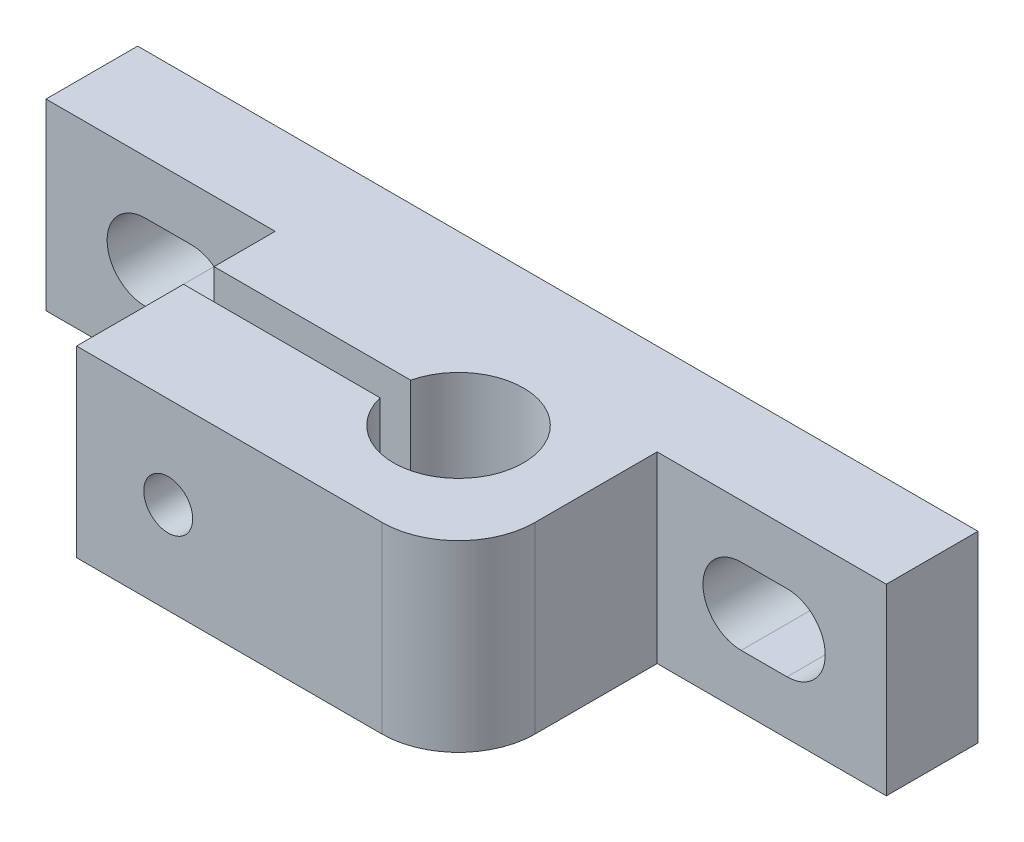
ISO-10303-21;
HEADER;
FILE_DESCRIPTION(('STEP AP214'),'2;1');
FILE_NAME('part.step','',(''),(''),'','','');
FILE_SCHEMA(('AUTOMOTIVE_DESIGN { 1 0 10303 214 1 1 1 1 }'));
ENDSEC;
DATA;
#1=APPLICATION_CONTEXT('core data for automotive mechanical design processes');
#2=APPLICATION_PROTOCOL_DEFINITION('international standard','automotive_design',2000,#1);
#3=PRODUCT_CONTEXT('',#1,'mechanical');
#4=PRODUCT('Part','Part','',(#3));
#5=PRODUCT_RELATED_PRODUCT_CATEGORY('part','',(#4));
#6=PRODUCT_DEFINITION_FORMATION('','',#4);
#7=PRODUCT_DEFINITION_CONTEXT('part definition',#1,'design');
#8=PRODUCT_DEFINITION('design','',#6,#7);
#9=PRODUCT_DEFINITION_SHAPE('','',#8);
#10=(LENGTH_UNIT() NAMED_UNIT(*) SI_UNIT(.MILLI.,.METRE.));
#11=(NAMED_UNIT(*) PLANE_ANGLE_UNIT() SI_UNIT($,.RADIAN.));
#12=(NAMED_UNIT(*) SI_UNIT($,.STERADIAN.) SOLID_ANGLE_UNIT());
#13=UNCERTAINTY_MEASURE_WITH_UNIT(LENGTH_MEASURE(1.E-05),#10,'distance_accuracy_value','');
#14=(GEOMETRIC_REPRESENTATION_CONTEXT(3) GLOBAL_UNCERTAINTY_ASSIGNED_CONTEXT((#13)) GLOBAL_UNIT_ASSIGNED_CONTEXT((#10,
#11,#12)) REPRESENTATION_CONTEXT('',''));
#15=CARTESIAN_POINT('',(0.,0.,0.));
#16=DIRECTION('',(0.,0.,1.));
#17=DIRECTION('',(1.,0.,0.));
#18=AXIS2_PLACEMENT_3D('',#15,#16,#17);
#19=CARTESIAN_POINT('',(15.,0.,19.));
#20=DIRECTION('',(1.,0.,0.));
#21=DIRECTION('',(0.,0.,-1.));
#22=AXIS2_PLACEMENT_3D('',#19,#20,#21);
#23=PLANE('',#22);
#24=DIRECTION('',(0.,0.,-1.));
#25=VECTOR('',#24,1.);
#26=CARTESIAN_POINT('',(15.,0.,19.));
#27=LINE('',#26,#25);
#28=CARTESIAN_POINT('',(15.,0.,10.));
#29=VERTEX_POINT('',#28);
#30=CARTESIAN_POINT('',(15.,0.,6.));
#31=VERTEX_POINT('',#30);
#32=EDGE_CURVE('E382',#29,#31,#27,.T.);
#33=ORIENTED_EDGE('',*,*,#32,.F.);
#34=DIRECTION('',(0.,1.,0.));
#35=VECTOR('',#34,1.);
#36=CARTESIAN_POINT('',(15.,0.,10.));
#37=LINE('',#36,#35);
#38=CARTESIAN_POINT('',(15.,12.,10.));
#39=VERTEX_POINT('',#38);
#40=EDGE_CURVE('E42',#29,#39,#37,.T.);
#41=ORIENTED_EDGE('',*,*,#40,.T.);
#42=DIRECTION('',(0.,0.,-1.));
#43=VECTOR('',#42,1.);
#44=CARTESIAN_POINT('',(15.,12.,19.));
#45=LINE('',#44,#43);
#46=CARTESIAN_POINT('',(15.,12.,6.));
#47=VERTEX_POINT('',#46);
#48=EDGE_CURVE('E359',#39,#47,#45,.T.);
#49=ORIENTED_EDGE('',*,*,#48,.T.);
#50=DIRECTION('',(0.,-1.,0.));
#51=VECTOR('',#50,1.);
#52=CARTESIAN_POINT('',(15.,0.,6.));
#53=LINE('',#52,#51);
#54=EDGE_CURVE('E349',#47,#31,#53,.T.);
#55=ORIENTED_EDGE('',*,*,#54,.T.);
#56=EDGE_LOOP('',(#33,#41,#49,#55));
#57=FACE_BOUND('',#56,.T.);
#58=ADVANCED_FACE('F33',(#57),#23,.F.);
#59=CARTESIAN_POINT('',(0.,0.,6.));
#60=DIRECTION('',(0.,0.,-1.));
#61=DIRECTION('',(-1.,0.,0.));
#62=AXIS2_PLACEMENT_3D('',#59,#60,#61);
#63=PLANE('',#62);
#64=CARTESIAN_POINT('',(6.5,6.,6.));
#65=DIRECTION('',(0.,0.,1.));
#66=DIRECTION('',(1.,0.,0.));
#67=AXIS2_PLACEMENT_3D('',#64,#65,#66);
#68=CIRCLE('',#67,2.50000000000001);
#69=CARTESIAN_POINT('',(6.5,8.5,6.));
#70=VERTEX_POINT('',#69);
#71=CARTESIAN_POINT('',(6.5,3.49999999999999,6.));
#72=VERTEX_POINT('',#71);
#73=EDGE_CURVE('E460',#70,#72,#68,.T.);
#74=ORIENTED_EDGE('',*,*,#73,.F.);
#75=DIRECTION('',(-1.,0.,0.));
#76=VECTOR('',#75,1.);
#77=CARTESIAN_POINT('',(6.5,8.5,6.));
#78=LINE('',#77,#76);
#79=CARTESIAN_POINT('',(9.5,8.5,6.));
#80=VERTEX_POINT('',#79);
#81=EDGE_CURVE('E456',#80,#70,#78,.T.);
#82=ORIENTED_EDGE('',*,*,#81,.F.);
#83=CARTESIAN_POINT('',(9.5,6.,6.));
#84=DIRECTION('',(0.,0.,1.));
#85=DIRECTION('',(1.,0.,0.));
#86=AXIS2_PLACEMENT_3D('',#83,#84,#85);
#87=CIRCLE('',#86,2.50000000000001);
#88=CARTESIAN_POINT('',(9.49999999999999,3.49999999999999,6.));
#89=VERTEX_POINT('',#88);
#90=EDGE_CURVE('E472',#89,#80,#87,.T.);
#91=ORIENTED_EDGE('',*,*,#90,.F.);
#92=DIRECTION('',(1.,0.,0.));
#93=VECTOR('',#92,1.);
#94=CARTESIAN_POINT('',(6.5,3.49999999999999,6.));
#95=LINE('',#94,#93);
#96=EDGE_CURVE('E475',#72,#89,#95,.T.);
#97=ORIENTED_EDGE('',*,*,#96,.F.);
#98=EDGE_LOOP('',(#74,#82,#91,#97));
#99=FACE_BOUND('',#98,.T.);
#100=ORIENTED_EDGE('',*,*,#54,.F.);
#101=DIRECTION('',(-1.,0.,0.));
#102=VECTOR('',#101,1.);
#103=CARTESIAN_POINT('',(0.,12.,6.));
#104=LINE('',#103,#102);
#105=CARTESIAN_POINT('',(0.,12.,6.));
#106=VERTEX_POINT('',#105);
#107=EDGE_CURVE('E399',#47,#106,#104,.T.);
#108=ORIENTED_EDGE('',*,*,#107,.T.);
#109=DIRECTION('',(0.,-1.,0.));
#110=VECTOR('',#109,1.);
#111=CARTESIAN_POINT('',(0.,0.,6.));
#112=LINE('',#111,#110);
#113=CARTESIAN_POINT('',(0.,0.,6.));
#114=VERTEX_POINT('',#113);
#115=EDGE_CURVE('E430',#106,#114,#112,.T.);
#116=ORIENTED_EDGE('',*,*,#115,.T.);
#117=DIRECTION('',(1.,0.,0.));
#118=VECTOR('',#117,1.);
#119=CARTESIAN_POINT('',(0.,0.,6.));
#120=LINE('',#119,#118);
#121=EDGE_CURVE('E410',#114,#31,#120,.T.);
#122=ORIENTED_EDGE('',*,*,#121,.T.);
#123=EDGE_LOOP('',(#100,#108,#116,#122));
#124=FACE_BOUND('',#123,.T.);
#125=ADVANCED_FACE('F541',(#99,#124),#63,.F.);
#126=CARTESIAN_POINT('',(48.5,6.00000000000001,6.));
#127=DIRECTION('',(0.,0.,1.));
#128=DIRECTION('',(-1.,0.,0.));
#129=AXIS2_PLACEMENT_3D('',#126,#127,#128);
#130=CIRCLE('',#129,2.50000000000001);
#131=CARTESIAN_POINT('',(48.5,3.49999999999999,6.));
#132=VERTEX_POINT('',#131);
#133=CARTESIAN_POINT('',(48.5,8.50000000000001,6.));
#134=VERTEX_POINT('',#133);
#135=EDGE_CURVE('E491',#132,#134,#130,.T.);
#136=ORIENTED_EDGE('',*,*,#135,.F.);
#137=DIRECTION('',(1.,0.,0.));
#138=VECTOR('',#137,1.);
#139=CARTESIAN_POINT('',(48.5,3.49999999999999,6.));
#140=LINE('',#139,#138);
#141=CARTESIAN_POINT('',(45.5,3.49999999999999,6.));
#142=VERTEX_POINT('',#141);
#143=EDGE_CURVE('E487',#142,#132,#140,.T.);
#144=ORIENTED_EDGE('',*,*,#143,.F.);
#145=CARTESIAN_POINT('',(45.5,6.,6.));
#146=DIRECTION('',(0.,0.,1.));
#147=DIRECTION('',(-1.,0.,0.));
#148=AXIS2_PLACEMENT_3D('',#145,#146,#147);
#149=CIRCLE('',#148,2.50000000000001);
#150=CARTESIAN_POINT('',(45.5,8.50000000000001,6.));
#151=VERTEX_POINT('',#150);
#152=EDGE_CURVE('E503',#151,#142,#149,.T.);
#153=ORIENTED_EDGE('',*,*,#152,.F.);
#154=DIRECTION('',(-1.,0.,0.));
#155=VECTOR('',#154,1.);
#156=CARTESIAN_POINT('',(48.5,8.50000000000001,6.));
#157=LINE('',#156,#155);
#158=EDGE_CURVE('E506',#134,#151,#157,.T.);
#159=ORIENTED_EDGE('',*,*,#158,.F.);
#160=EDGE_LOOP('',(#136,#144,#153,#159));
#161=FACE_BOUND('',#160,.T.);
#162=DIRECTION('',(0.,1.,0.));
#163=VECTOR('',#162,1.);
#164=CARTESIAN_POINT('',(40.,0.,6.));
#165=LINE('',#164,#163);
#166=CARTESIAN_POINT('',(40.,0.,6.));
#167=VERTEX_POINT('',#166);
#168=CARTESIAN_POINT('',(40.,12.,6.));
#169=VERTEX_POINT('',#168);
#170=EDGE_CURVE('E354',#167,#169,#165,.T.);
#171=ORIENTED_EDGE('',*,*,#170,.F.);
#172=CARTESIAN_POINT('',(55.,0.,6.));
#173=VERTEX_POINT('',#172);
#174=EDGE_CURVE('E442',#167,#173,#120,.T.);
#175=ORIENTED_EDGE('',*,*,#174,.T.);
#176=DIRECTION('',(0.,1.,0.));
#177=VECTOR('',#176,1.);
#178=CARTESIAN_POINT('',(55.,0.,6.));
#179=LINE('',#178,#177);
#180=CARTESIAN_POINT('',(55.,12.,6.));
#181=VERTEX_POINT('',#180);
#182=EDGE_CURVE('E406',#173,#181,#179,.T.);
#183=ORIENTED_EDGE('',*,*,#182,.T.);
#184=EDGE_CURVE('E405',#181,#169,#104,.T.);
#185=ORIENTED_EDGE('',*,*,#184,.T.);
#186=EDGE_LOOP('',(#171,#175,#183,#185));
#187=FACE_BOUND('',#186,.T.);
#188=ADVANCED_FACE('F519',(#161,#187),#63,.F.);
#189=CARTESIAN_POINT('',(0.,0.,0.));
#190=DIRECTION('',(0.,0.,-1.));
#191=DIRECTION('',(-1.,0.,0.));
#192=AXIS2_PLACEMENT_3D('',#189,#190,#191);
#193=PLANE('',#192);
#194=DIRECTION('',(0.,-1.,0.));
#195=VECTOR('',#194,1.);
#196=CARTESIAN_POINT('',(37.6724189772482,9.5,0.));
#197=LINE('',#196,#195);
#198=CARTESIAN_POINT('',(37.6724189772482,9.5,0.));
#199=VERTEX_POINT('',#198);
#200=CARTESIAN_POINT('',(37.6724189772482,2.5,0.));
#201=VERTEX_POINT('',#200);
#202=EDGE_CURVE('E57',#199,#201,#197,.T.);
#203=ORIENTED_EDGE('',*,*,#202,.F.);
#204=DIRECTION('',(1.,0.,0.));
#205=VECTOR('',#204,1.);
#206=CARTESIAN_POINT('',(37.6724189772482,9.5,0.));
#207=LINE('',#206,#205);
#208=CARTESIAN_POINT('',(17.15852847,9.5,0.));
#209=VERTEX_POINT('',#208);
#210=EDGE_CURVE('E305',#209,#199,#207,.T.);
#211=ORIENTED_EDGE('',*,*,#210,.F.);
#212=DIRECTION('',(0.,1.,0.));
#213=VECTOR('',#212,1.);
#214=CARTESIAN_POINT('',(17.15852847,9.5,0.));
#215=LINE('',#214,#213);
#216=CARTESIAN_POINT('',(17.15852847,2.5,0.));
#217=VERTEX_POINT('',#216);
#218=EDGE_CURVE('E319',#217,#209,#215,.T.);
#219=ORIENTED_EDGE('',*,*,#218,.F.);
#220=DIRECTION('',(-1.,0.,0.));
#221=VECTOR('',#220,1.);
#222=CARTESIAN_POINT('',(37.6724189772482,2.5,0.));
#223=LINE('',#222,#221);
#224=EDGE_CURVE('E316',#201,#217,#223,.T.);
#225=ORIENTED_EDGE('',*,*,#224,.F.);
#226=EDGE_LOOP('',(#203,#211,#219,#225));
#227=FACE_BOUND('',#226,.T.);
#228=DIRECTION('',(-1.,0.,0.));
#229=VECTOR('',#228,1.);
#230=CARTESIAN_POINT('',(6.5,8.5,0.));
#231=LINE('',#230,#229);
#232=CARTESIAN_POINT('',(9.5,8.5,0.));
#233=VERTEX_POINT('',#232);
#234=CARTESIAN_POINT('',(6.5,8.5,0.));
#235=VERTEX_POINT('',#234);
#236=EDGE_CURVE('E457',#233,#235,#231,.T.);
#237=ORIENTED_EDGE('',*,*,#236,.T.);
#238=CARTESIAN_POINT('',(6.5,6.,0.));
#239=DIRECTION('',(0.,0.,1.));
#240=DIRECTION('',(1.,0.,0.));
#241=AXIS2_PLACEMENT_3D('',#238,#239,#240);
#242=CIRCLE('',#241,2.50000000000001);
#243=CARTESIAN_POINT('',(6.5,3.49999999999999,0.));
#244=VERTEX_POINT('',#243);
#245=EDGE_CURVE('E467',#235,#244,#242,.T.);
#246=ORIENTED_EDGE('',*,*,#245,.T.);
#247=DIRECTION('',(1.,0.,0.));
#248=VECTOR('',#247,1.);
#249=CARTESIAN_POINT('',(6.5,3.49999999999999,0.));
#250=LINE('',#249,#248);
#251=CARTESIAN_POINT('',(9.49999999999999,3.49999999999999,0.));
#252=VERTEX_POINT('',#251);
#253=EDGE_CURVE('E464',#244,#252,#250,.T.);
#254=ORIENTED_EDGE('',*,*,#253,.T.);
#255=CARTESIAN_POINT('',(9.5,6.,0.));
#256=DIRECTION('',(0.,0.,1.));
#257=DIRECTION('',(1.,0.,0.));
#258=AXIS2_PLACEMENT_3D('',#255,#256,#257);
#259=CIRCLE('',#258,2.50000000000001);
#260=EDGE_CURVE('E461',#252,#233,#259,.T.);
#261=ORIENTED_EDGE('',*,*,#260,.T.);
#262=EDGE_LOOP('',(#237,#246,#254,#261));
#263=FACE_BOUND('',#262,.T.);
#264=DIRECTION('',(0.,-1.,0.));
#265=VECTOR('',#264,1.);
#266=CARTESIAN_POINT('',(0.,0.,0.));
#267=LINE('',#266,#265);
#268=CARTESIAN_POINT('',(0.,12.,0.));
#269=VERTEX_POINT('',#268);
#270=CARTESIAN_POINT('',(0.,0.,0.));
#271=VERTEX_POINT('',#270);
#272=EDGE_CURVE('E419',#269,#271,#267,.T.);
#273=ORIENTED_EDGE('',*,*,#272,.F.);
#274=DIRECTION('',(-1.,0.,0.));
#275=VECTOR('',#274,1.);
#276=CARTESIAN_POINT('',(0.,12.,0.));
#277=LINE('',#276,#275);
#278=CARTESIAN_POINT('',(55.,12.,0.));
#279=VERTEX_POINT('',#278);
#280=EDGE_CURVE('E428',#279,#269,#277,.T.);
#281=ORIENTED_EDGE('',*,*,#280,.F.);
#282=DIRECTION('',(0.,1.,0.));
#283=VECTOR('',#282,1.);
#284=CARTESIAN_POINT('',(55.,0.,0.));
#285=LINE('',#284,#283);
#286=CARTESIAN_POINT('',(55.,0.,0.));
#287=VERTEX_POINT('',#286);
#288=EDGE_CURVE('E426',#287,#279,#285,.T.);
#289=ORIENTED_EDGE('',*,*,#288,.F.);
#290=DIRECTION('',(1.,0.,0.));
#291=VECTOR('',#290,1.);
#292=CARTESIAN_POINT('',(0.,0.,0.));
#293=LINE('',#292,#291);
#294=EDGE_CURVE('E423',#271,#287,#293,.T.);
#295=ORIENTED_EDGE('',*,*,#294,.F.);
#296=EDGE_LOOP('',(#273,#281,#289,#295));
#297=FACE_BOUND('',#296,.T.);
#298=DIRECTION('',(1.,0.,0.));
#299=VECTOR('',#298,1.);
#300=CARTESIAN_POINT('',(48.5,3.49999999999999,0.));
#301=LINE('',#300,#299);
#302=CARTESIAN_POINT('',(45.5,3.5,0.));
#303=VERTEX_POINT('',#302);
#304=CARTESIAN_POINT('',(48.5,3.49999999999999,0.));
#305=VERTEX_POINT('',#304);
#306=EDGE_CURVE('E488',#303,#305,#301,.T.);
#307=ORIENTED_EDGE('',*,*,#306,.T.);
#308=CARTESIAN_POINT('',(48.5,6.00000000000001,0.));
#309=DIRECTION('',(0.,0.,1.));
#310=DIRECTION('',(-1.,0.,0.));
#311=AXIS2_PLACEMENT_3D('',#308,#309,#310);
#312=CIRCLE('',#311,2.50000000000001);
#313=CARTESIAN_POINT('',(48.5,8.50000000000001,0.));
#314=VERTEX_POINT('',#313);
#315=EDGE_CURVE('E498',#305,#314,#312,.T.);
#316=ORIENTED_EDGE('',*,*,#315,.T.);
#317=DIRECTION('',(-1.,0.,0.));
#318=VECTOR('',#317,1.);
#319=CARTESIAN_POINT('',(48.5,8.50000000000001,0.));
#320=LINE('',#319,#318);
#321=CARTESIAN_POINT('',(45.5,8.50000000000001,0.));
#322=VERTEX_POINT('',#321);
#323=EDGE_CURVE('E495',#314,#322,#320,.T.);
#324=ORIENTED_EDGE('',*,*,#323,.T.);
#325=CARTESIAN_POINT('',(45.5,6.,0.));
#326=DIRECTION('',(0.,0.,1.));
#327=DIRECTION('',(-1.,0.,0.));
#328=AXIS2_PLACEMENT_3D('',#325,#326,#327);
#329=CIRCLE('',#328,2.50000000000001);
#330=EDGE_CURVE('E492',#322,#303,#329,.T.);
#331=ORIENTED_EDGE('',*,*,#330,.T.);
#332=EDGE_LOOP('',(#307,#316,#324,#331));
#333=FACE_BOUND('',#332,.T.);
#334=ADVANCED_FACE('F526',(#227,#263,#297,#333),#193,.T.);
#335=CARTESIAN_POINT('',(0.,0.,6.));
#336=DIRECTION('',(1.,0.,0.));
#337=DIRECTION('',(0.,0.,-1.));
#338=AXIS2_PLACEMENT_3D('',#335,#336,#337);
#339=PLANE('',#338);
#340=ORIENTED_EDGE('',*,*,#272,.T.);
#341=DIRECTION('',(0.,0.,-1.));
#342=VECTOR('',#341,1.);
#343=CARTESIAN_POINT('',(0.,0.,6.));
#344=LINE('',#343,#342);
#345=EDGE_CURVE('E438',#114,#271,#344,.T.);
#346=ORIENTED_EDGE('',*,*,#345,.F.);
#347=ORIENTED_EDGE('',*,*,#115,.F.);
#348=DIRECTION('',(0.,0.,-1.));
#349=VECTOR('',#348,1.);
#350=CARTESIAN_POINT('',(0.,12.,6.));
#351=LINE('',#350,#349);
#352=EDGE_CURVE('E401',#106,#269,#351,.T.);
#353=ORIENTED_EDGE('',*,*,#352,.T.);
#354=EDGE_LOOP('',(#340,#346,#347,#353));
#355=FACE_BOUND('',#354,.T.);
#356=ADVANCED_FACE('F757',(#355),#339,.F.);
#357=CARTESIAN_POINT('',(0.,0.,6.));
#358=DIRECTION('',(0.,1.,0.));
#359=DIRECTION('',(0.,0.,1.));
#360=AXIS2_PLACEMENT_3D('',#357,#358,#359);
#361=PLANE('',#360);
#362=CARTESIAN_POINT('',(32.,0.,11.));
#363=DIRECTION('',(0.,-1.,0.));
#364=DIRECTION('',(0.,0.,-1.));
#365=AXIS2_PLACEMENT_3D('',#362,#363,#364);
#366=CIRCLE('',#365,4.25000000000001);
#367=CARTESIAN_POINT('',(27.8693220895354,0.,10.));
#368=VERTEX_POINT('',#367);
#369=CARTESIAN_POINT('',(27.8693220895354,0.,12.));
#370=VERTEX_POINT('',#369);
#371=EDGE_CURVE('E334',#368,#370,#366,.T.);
#372=ORIENTED_EDGE('',*,*,#371,.F.);
#373=DIRECTION('',(1.,0.,0.));
#374=VECTOR('',#373,1.);
#375=CARTESIAN_POINT('',(0.,0.,10.));
#376=LINE('',#375,#374);
#377=EDGE_CURVE('E326',#29,#368,#376,.T.);
#378=ORIENTED_EDGE('',*,*,#377,.F.);
#379=ORIENTED_EDGE('',*,*,#32,.T.);
#380=ORIENTED_EDGE('',*,*,#121,.F.);
#381=ORIENTED_EDGE('',*,*,#345,.T.);
#382=ORIENTED_EDGE('',*,*,#294,.T.);
#383=DIRECTION('',(0.,0.,-1.));
#384=VECTOR('',#383,1.);
#385=CARTESIAN_POINT('',(55.,0.,6.));
#386=LINE('',#385,#384);
#387=EDGE_CURVE('E435',#173,#287,#386,.T.);
#388=ORIENTED_EDGE('',*,*,#387,.F.);
#389=ORIENTED_EDGE('',*,*,#174,.F.);
#390=DIRECTION('',(0.,0.,-1.));
#391=VECTOR('',#390,1.);
#392=CARTESIAN_POINT('',(40.,0.,19.));
#393=LINE('',#392,#391);
#394=CARTESIAN_POINT('',(40.,0.,14.));
#395=VERTEX_POINT('',#394);
#396=EDGE_CURVE('E867',#395,#167,#393,.T.);
#397=ORIENTED_EDGE('',*,*,#396,.F.);
#398=CARTESIAN_POINT('',(35.,0.,14.));
#399=DIRECTION('',(0.,1.,0.));
#400=DIRECTION('',(0.,0.,1.));
#401=AXIS2_PLACEMENT_3D('',#398,#399,#400);
#402=CIRCLE('',#401,5.);
#403=CARTESIAN_POINT('',(35.,0.,19.));
#404=VERTEX_POINT('',#403);
#405=EDGE_CURVE('E387',#395,#404,#402,.F.);
#406=ORIENTED_EDGE('',*,*,#405,.T.);
#407=DIRECTION('',(1.,0.,0.));
#408=VECTOR('',#407,1.);
#409=CARTESIAN_POINT('',(15.,0.,19.));
#410=LINE('',#409,#408);
#411=CARTESIAN_POINT('',(15.,0.,19.));
#412=VERTEX_POINT('',#411);
#413=EDGE_CURVE('E353',#412,#404,#410,.T.);
#414=ORIENTED_EDGE('',*,*,#413,.F.);
#415=CARTESIAN_POINT('',(15.,0.,12.));
#416=VERTEX_POINT('',#415);
#417=EDGE_CURVE('E501',#412,#416,#27,.T.);
#418=ORIENTED_EDGE('',*,*,#417,.T.);
#419=DIRECTION('',(-1.,0.,0.));
#420=VECTOR('',#419,1.);
#421=CARTESIAN_POINT('',(0.,0.,12.));
#422=LINE('',#421,#420);
#423=EDGE_CURVE('E337',#370,#416,#422,.T.);
#424=ORIENTED_EDGE('',*,*,#423,.F.);
#425=EDGE_LOOP('',(#372,#378,#379,#380,#381,#382,#388,#389,#397,#406,#414,#418,#424));
#426=FACE_BOUND('',#425,.T.);
#427=ADVANCED_FACE('F751',(#426),#361,.F.);
#428=CARTESIAN_POINT('',(55.,0.,6.));
#429=DIRECTION('',(-1.,0.,0.));
#430=DIRECTION('',(0.,0.,1.));
#431=AXIS2_PLACEMENT_3D('',#428,#429,#430);
#432=PLANE('',#431);
#433=ORIENTED_EDGE('',*,*,#288,.T.);
#434=DIRECTION('',(0.,0.,-1.));
#435=VECTOR('',#434,1.);
#436=CARTESIAN_POINT('',(55.,12.,6.));
#437=LINE('',#436,#435);
#438=EDGE_CURVE('E432',#181,#279,#437,.T.);
#439=ORIENTED_EDGE('',*,*,#438,.F.);
#440=ORIENTED_EDGE('',*,*,#182,.F.);
#441=ORIENTED_EDGE('',*,*,#387,.T.);
#442=EDGE_LOOP('',(#433,#439,#440,#441));
#443=FACE_BOUND('',#442,.T.);
#444=ADVANCED_FACE('F744',(#443),#432,.F.);
#445=CARTESIAN_POINT('',(0.,12.,6.));
#446=DIRECTION('',(0.,-1.,0.));
#447=DIRECTION('',(0.,0.,-1.));
#448=AXIS2_PLACEMENT_3D('',#445,#446,#447);
#449=PLANE('',#448);
#450=ORIENTED_EDGE('',*,*,#48,.F.);
#451=DIRECTION('',(1.,0.,0.));
#452=VECTOR('',#451,1.);
#453=CARTESIAN_POINT('',(0.,12.,10.));
#454=LINE('',#453,#452);
#455=CARTESIAN_POINT('',(27.8693220895354,12.,10.));
#456=VERTEX_POINT('',#455);
#457=EDGE_CURVE('E346',#39,#456,#454,.T.);
#458=ORIENTED_EDGE('',*,*,#457,.T.);
#459=CARTESIAN_POINT('',(32.,12.,11.));
#460=DIRECTION('',(0.,-1.,0.));
#461=DIRECTION('',(0.,0.,-1.));
#462=AXIS2_PLACEMENT_3D('',#459,#460,#461);
#463=CIRCLE('',#462,4.25000000000001);
#464=CARTESIAN_POINT('',(27.8693220895354,12.,12.));
#465=VERTEX_POINT('',#464);
#466=EDGE_CURVE('E11',#456,#465,#463,.T.);
#467=ORIENTED_EDGE('',*,*,#466,.T.);
#468=DIRECTION('',(-1.,0.,0.));
#469=VECTOR('',#468,1.);
#470=CARTESIAN_POINT('',(0.,12.,12.));
#471=LINE('',#470,#469);
#472=CARTESIAN_POINT('',(15.,12.,12.));
#473=VERTEX_POINT('',#472);
#474=EDGE_CURVE('E342',#465,#473,#471,.T.);
#475=ORIENTED_EDGE('',*,*,#474,.T.);
#476=CARTESIAN_POINT('',(15.,12.,19.));
#477=VERTEX_POINT('',#476);
#478=EDGE_CURVE('E370',#477,#473,#45,.T.);
#479=ORIENTED_EDGE('',*,*,#478,.F.);
#480=DIRECTION('',(-1.,0.,0.));
#481=VECTOR('',#480,1.);
#482=CARTESIAN_POINT('',(15.,12.,19.));
#483=LINE('',#482,#481);
#484=CARTESIAN_POINT('',(35.,12.,19.));
#485=VERTEX_POINT('',#484);
#486=EDGE_CURVE('E357',#485,#477,#483,.T.);
#487=ORIENTED_EDGE('',*,*,#486,.F.);
#488=CARTESIAN_POINT('',(35.,12.,14.));
#489=DIRECTION('',(0.,-1.,0.));
#490=DIRECTION('',(0.,0.,-1.));
#491=AXIS2_PLACEMENT_3D('',#488,#489,#490);
#492=CIRCLE('',#491,5.);
#493=CARTESIAN_POINT('',(40.,12.,14.));
#494=VERTEX_POINT('',#493);
#495=EDGE_CURVE('E876',#485,#494,#492,.F.);
#496=ORIENTED_EDGE('',*,*,#495,.T.);
#497=DIRECTION('',(0.,0.,-1.));
#498=VECTOR('',#497,1.);
#499=CARTESIAN_POINT('',(40.,12.,19.));
#500=LINE('',#499,#498);
#501=EDGE_CURVE('E373',#494,#169,#500,.T.);
#502=ORIENTED_EDGE('',*,*,#501,.T.);
#503=ORIENTED_EDGE('',*,*,#184,.F.);
#504=ORIENTED_EDGE('',*,*,#438,.T.);
#505=ORIENTED_EDGE('',*,*,#280,.T.);
#506=ORIENTED_EDGE('',*,*,#352,.F.);
#507=ORIENTED_EDGE('',*,*,#107,.F.);
#508=EDGE_LOOP('',(#450,#458,#467,#475,#479,#487,#496,#502,#503,#504,#505,#506,#507));
#509=FACE_BOUND('',#508,.T.);
#510=ADVANCED_FACE('F397',(#509),#449,.F.);
#511=CARTESIAN_POINT('',(6.5,6.,6.));
#512=DIRECTION('',(0.,0.,-1.));
#513=DIRECTION('',(-1.,0.,0.));
#514=AXIS2_PLACEMENT_3D('',#511,#512,#513);
#515=CYLINDRICAL_SURFACE('',#514,2.50000000000001);
#516=ORIENTED_EDGE('',*,*,#245,.F.);
#517=DIRECTION('',(0.,0.,-1.));
#518=VECTOR('',#517,1.);
#519=CARTESIAN_POINT('',(6.5,8.5,6.));
#520=LINE('',#519,#518);
#521=EDGE_CURVE('E453',#70,#235,#520,.T.);
#522=ORIENTED_EDGE('',*,*,#521,.F.);
#523=ORIENTED_EDGE('',*,*,#73,.T.);
#524=DIRECTION('',(0.,0.,-1.));
#525=VECTOR('',#524,1.);
#526=CARTESIAN_POINT('',(6.5,3.49999999999999,6.));
#527=LINE('',#526,#525);
#528=EDGE_CURVE('E424',#72,#244,#527,.T.);
#529=ORIENTED_EDGE('',*,*,#528,.T.);
#530=EDGE_LOOP('',(#516,#522,#523,#529));
#531=FACE_BOUND('',#530,.T.);
#532=ADVANCED_FACE('F743',(#531),#515,.F.);
#533=CARTESIAN_POINT('',(6.5,3.49999999999999,6.));
#534=DIRECTION('',(0.,1.,0.));
#535=DIRECTION('',(0.,0.,1.));
#536=AXIS2_PLACEMENT_3D('',#533,#534,#535);
#537=PLANE('',#536);
#538=ORIENTED_EDGE('',*,*,#253,.F.);
#539=ORIENTED_EDGE('',*,*,#528,.F.);
#540=ORIENTED_EDGE('',*,*,#96,.T.);
#541=DIRECTION('',(0.,0.,-1.));
#542=VECTOR('',#541,1.);
#543=CARTESIAN_POINT('',(9.49999999999999,3.49999999999999,6.));
#544=LINE('',#543,#542);
#545=EDGE_CURVE('E449',#89,#252,#544,.T.);
#546=ORIENTED_EDGE('',*,*,#545,.T.);
#547=EDGE_LOOP('',(#538,#539,#540,#546));
#548=FACE_BOUND('',#547,.T.);
#549=ADVANCED_FACE('F812',(#548),#537,.T.);
#550=CARTESIAN_POINT('',(9.5,6.,6.));
#551=DIRECTION('',(0.,0.,-1.));
#552=DIRECTION('',(-1.,0.,0.));
#553=AXIS2_PLACEMENT_3D('',#550,#551,#552);
#554=CYLINDRICAL_SURFACE('',#553,2.50000000000001);
#555=ORIENTED_EDGE('',*,*,#260,.F.);
#556=ORIENTED_EDGE('',*,*,#545,.F.);
#557=ORIENTED_EDGE('',*,*,#90,.T.);
#558=DIRECTION('',(0.,0.,-1.));
#559=VECTOR('',#558,1.);
#560=CARTESIAN_POINT('',(9.5,8.5,6.));
#561=LINE('',#560,#559);
#562=EDGE_CURVE('E451',#80,#233,#561,.T.);
#563=ORIENTED_EDGE('',*,*,#562,.T.);
#564=EDGE_LOOP('',(#555,#556,#557,#563));
#565=FACE_BOUND('',#564,.T.);
#566=ADVANCED_FACE('F803',(#565),#554,.F.);
#567=CARTESIAN_POINT('',(6.5,8.5,6.));
#568=DIRECTION('',(0.,-1.,0.));
#569=DIRECTION('',(0.,0.,-1.));
#570=AXIS2_PLACEMENT_3D('',#567,#568,#569);
#571=PLANE('',#570);
#572=ORIENTED_EDGE('',*,*,#236,.F.);
#573=ORIENTED_EDGE('',*,*,#562,.F.);
#574=ORIENTED_EDGE('',*,*,#81,.T.);
#575=ORIENTED_EDGE('',*,*,#521,.T.);
#576=EDGE_LOOP('',(#572,#573,#574,#575));
#577=FACE_BOUND('',#576,.T.);
#578=ADVANCED_FACE('F795',(#577),#571,.T.);
#579=CARTESIAN_POINT('',(48.5,6.00000000000001,6.));
#580=DIRECTION('',(0.,0.,-1.));
#581=DIRECTION('',(-1.,0.,0.));
#582=AXIS2_PLACEMENT_3D('',#579,#580,#581);
#583=CYLINDRICAL_SURFACE('',#582,2.50000000000001);
#584=ORIENTED_EDGE('',*,*,#315,.F.);
#585=DIRECTION('',(0.,0.,-1.));
#586=VECTOR('',#585,1.);
#587=CARTESIAN_POINT('',(48.5,3.49999999999999,6.));
#588=LINE('',#587,#586);
#589=EDGE_CURVE('E484',#132,#305,#588,.T.);
#590=ORIENTED_EDGE('',*,*,#589,.F.);
#591=ORIENTED_EDGE('',*,*,#135,.T.);
#592=DIRECTION('',(0.,0.,-1.));
#593=VECTOR('',#592,1.);
#594=CARTESIAN_POINT('',(48.5,8.50000000000001,6.));
#595=LINE('',#594,#593);
#596=EDGE_CURVE('E470',#134,#314,#595,.T.);
#597=ORIENTED_EDGE('',*,*,#596,.T.);
#598=EDGE_LOOP('',(#584,#590,#591,#597));
#599=FACE_BOUND('',#598,.T.);
#600=ADVANCED_FACE('F511',(#599),#583,.F.);
#601=CARTESIAN_POINT('',(48.5,8.50000000000001,6.));
#602=DIRECTION('',(0.,-1.,0.));
#603=DIRECTION('',(0.,0.,-1.));
#604=AXIS2_PLACEMENT_3D('',#601,#602,#603);
#605=PLANE('',#604);
#606=ORIENTED_EDGE('',*,*,#323,.F.);
#607=ORIENTED_EDGE('',*,*,#596,.F.);
#608=ORIENTED_EDGE('',*,*,#158,.T.);
#609=DIRECTION('',(0.,0.,-1.));
#610=VECTOR('',#609,1.);
#611=CARTESIAN_POINT('',(45.5,8.50000000000001,6.));
#612=LINE('',#611,#610);
#613=EDGE_CURVE('E480',#151,#322,#612,.T.);
#614=ORIENTED_EDGE('',*,*,#613,.T.);
#615=EDGE_LOOP('',(#606,#607,#608,#614));
#616=FACE_BOUND('',#615,.T.);
#617=ADVANCED_FACE('F516',(#616),#605,.T.);
#618=CARTESIAN_POINT('',(45.5,6.,6.));
#619=DIRECTION('',(0.,0.,-1.));
#620=DIRECTION('',(-1.,0.,0.));
#621=AXIS2_PLACEMENT_3D('',#618,#619,#620);
#622=CYLINDRICAL_SURFACE('',#621,2.50000000000001);
#623=ORIENTED_EDGE('',*,*,#330,.F.);
#624=ORIENTED_EDGE('',*,*,#613,.F.);
#625=ORIENTED_EDGE('',*,*,#152,.T.);
#626=DIRECTION('',(0.,0.,-1.));
#627=VECTOR('',#626,1.);
#628=CARTESIAN_POINT('',(45.5,3.5,6.));
#629=LINE('',#628,#627);
#630=EDGE_CURVE('E482',#142,#303,#629,.T.);
#631=ORIENTED_EDGE('',*,*,#630,.T.);
#632=EDGE_LOOP('',(#623,#624,#625,#631));
#633=FACE_BOUND('',#632,.T.);
#634=ADVANCED_FACE('F523',(#633),#622,.F.);
#635=CARTESIAN_POINT('',(48.5,3.49999999999999,6.));
#636=DIRECTION('',(0.,1.,0.));
#637=DIRECTION('',(-1.,0.,0.));
#638=AXIS2_PLACEMENT_3D('',#635,#636,#637);
#639=PLANE('',#638);
#640=ORIENTED_EDGE('',*,*,#306,.F.);
#641=ORIENTED_EDGE('',*,*,#630,.F.);
#642=ORIENTED_EDGE('',*,*,#143,.T.);
#643=ORIENTED_EDGE('',*,*,#589,.T.);
#644=EDGE_LOOP('',(#640,#641,#642,#643));
#645=FACE_BOUND('',#644,.T.);
#646=ADVANCED_FACE('F528',(#645),#639,.T.);
#647=ORIENTED_EDGE('',*,*,#478,.T.);
#648=DIRECTION('',(0.,-1.,0.));
#649=VECTOR('',#648,1.);
#650=CARTESIAN_POINT('',(15.,0.,12.));
#651=LINE('',#650,#649);
#652=EDGE_CURVE('E384',#473,#416,#651,.T.);
#653=ORIENTED_EDGE('',*,*,#652,.T.);
#654=ORIENTED_EDGE('',*,*,#417,.F.);
#655=DIRECTION('',(0.,-1.,0.));
#656=VECTOR('',#655,1.);
#657=CARTESIAN_POINT('',(15.,0.,19.));
#658=LINE('',#657,#656);
#659=EDGE_CURVE('E350',#477,#412,#658,.T.);
#660=ORIENTED_EDGE('',*,*,#659,.F.);
#661=EDGE_LOOP('',(#647,#653,#654,#660));
#662=FACE_BOUND('',#661,.T.);
#663=ADVANCED_FACE('F530',(#662),#23,.F.);
#664=CARTESIAN_POINT('',(40.,0.,19.));
#665=DIRECTION('',(-1.,0.,0.));
#666=DIRECTION('',(0.,0.,1.));
#667=AXIS2_PLACEMENT_3D('',#664,#665,#666);
#668=PLANE('',#667);
#669=ORIENTED_EDGE('',*,*,#501,.F.);
#670=DIRECTION('',(0.,1.,0.));
#671=VECTOR('',#670,1.);
#672=CARTESIAN_POINT('',(40.,0.,14.));
#673=LINE('',#672,#671);
#674=EDGE_CURVE('E877',#494,#395,#673,.F.);
#675=ORIENTED_EDGE('',*,*,#674,.T.);
#676=ORIENTED_EDGE('',*,*,#396,.T.);
#677=ORIENTED_EDGE('',*,*,#170,.T.);
#678=EDGE_LOOP('',(#669,#675,#676,#677));
#679=FACE_BOUND('',#678,.T.);
#680=ADVANCED_FACE('F536',(#679),#668,.F.);
#681=CARTESIAN_POINT('',(0.,0.,19.));
#682=DIRECTION('',(0.,0.,-1.));
#683=DIRECTION('',(-1.,0.,0.));
#684=AXIS2_PLACEMENT_3D('',#681,#682,#683);
#685=PLANE('',#684);
#686=CARTESIAN_POINT('',(21.,6.,19.));
#687=DIRECTION('',(0.,0.,1.));
#688=DIRECTION('',(1.,0.,0.));
#689=AXIS2_PLACEMENT_3D('',#686,#687,#688);
#690=CIRCLE('',#689,1.6);
#691=CARTESIAN_POINT('',(22.6,6.,19.));
#692=VERTEX_POINT('',#691);
#693=EDGE_CURVE('E295',#692,#692,#690,.T.);
#694=ORIENTED_EDGE('',*,*,#693,.F.);
#695=EDGE_LOOP('',(#694));
#696=FACE_BOUND('',#695,.T.);
#697=ORIENTED_EDGE('',*,*,#413,.T.);
#698=DIRECTION('',(0.,1.,0.));
#699=VECTOR('',#698,1.);
#700=CARTESIAN_POINT('',(35.,0.,19.));
#701=LINE('',#700,#699);
#702=EDGE_CURVE('E376',#404,#485,#701,.T.);
#703=ORIENTED_EDGE('',*,*,#702,.T.);
#704=ORIENTED_EDGE('',*,*,#486,.T.);
#705=ORIENTED_EDGE('',*,*,#659,.T.);
#706=EDGE_LOOP('',(#697,#703,#704,#705));
#707=FACE_BOUND('',#706,.T.);
#708=ADVANCED_FACE('F550',(#696,#707),#685,.F.);
#709=CARTESIAN_POINT('',(35.,0.,14.));
#710=DIRECTION('',(0.,1.,0.));
#711=DIRECTION('',(0.,0.,1.));
#712=AXIS2_PLACEMENT_3D('',#709,#710,#711);
#713=CYLINDRICAL_SURFACE('',#712,5.);
#714=ORIENTED_EDGE('',*,*,#405,.F.);
#715=ORIENTED_EDGE('',*,*,#674,.F.);
#716=ORIENTED_EDGE('',*,*,#495,.F.);
#717=ORIENTED_EDGE('',*,*,#702,.F.);
#718=EDGE_LOOP('',(#714,#715,#716,#717));
#719=FACE_BOUND('',#718,.T.);
#720=ADVANCED_FACE('F35',(#719),#713,.T.);
#721=CARTESIAN_POINT('',(32.,30.,11.));
#722=DIRECTION('',(0.,-1.,0.));
#723=DIRECTION('',(0.,0.,-1.));
#724=AXIS2_PLACEMENT_3D('',#721,#722,#723);
#725=CYLINDRICAL_SURFACE('',#724,4.25000000000001);
#726=DIRECTION('',(0.,-1.,0.));
#727=VECTOR('',#726,1.);
#728=CARTESIAN_POINT('',(27.8693220895354,30.,10.));
#729=LINE('',#728,#727);
#730=EDGE_CURVE('E339',#456,#368,#729,.T.);
#731=ORIENTED_EDGE('',*,*,#730,.T.);
#732=ORIENTED_EDGE('',*,*,#371,.T.);
#733=DIRECTION('',(0.,-1.,0.));
#734=VECTOR('',#733,1.);
#735=CARTESIAN_POINT('',(27.8693220895354,30.,12.));
#736=LINE('',#735,#734);
#737=EDGE_CURVE('E340',#465,#370,#736,.T.);
#738=ORIENTED_EDGE('',*,*,#737,.F.);
#739=ORIENTED_EDGE('',*,*,#466,.F.);
#740=EDGE_LOOP('',(#731,#732,#738,#739));
#741=FACE_BOUND('',#740,.T.);
#742=ADVANCED_FACE('F559',(#741),#725,.F.);
#743=CARTESIAN_POINT('',(0.,30.,10.));
#744=DIRECTION('',(0.,0.,-1.));
#745=DIRECTION('',(-1.,0.,0.));
#746=AXIS2_PLACEMENT_3D('',#743,#744,#745);
#747=PLANE('',#746);
#748=CARTESIAN_POINT('',(21.,6.,10.));
#749=DIRECTION('',(0.,0.,-1.));
#750=DIRECTION('',(-1.,0.,0.));
#751=AXIS2_PLACEMENT_3D('',#748,#749,#750);
#752=CIRCLE('',#751,1.6);
#753=CARTESIAN_POINT('',(19.4,6.,10.));
#754=VERTEX_POINT('',#753);
#755=EDGE_CURVE('E298',#754,#754,#752,.T.);
#756=ORIENTED_EDGE('',*,*,#755,.T.);
#757=EDGE_LOOP('',(#756));
#758=FACE_BOUND('',#757,.T.);
#759=ORIENTED_EDGE('',*,*,#40,.F.);
#760=ORIENTED_EDGE('',*,*,#377,.T.);
#761=ORIENTED_EDGE('',*,*,#730,.F.);
#762=ORIENTED_EDGE('',*,*,#457,.F.);
#763=EDGE_LOOP('',(#759,#760,#761,#762));
#764=FACE_BOUND('',#763,.T.);
#765=ADVANCED_FACE('F555',(#758,#764),#747,.F.);
#766=CARTESIAN_POINT('',(0.,30.,12.));
#767=DIRECTION('',(0.,0.,1.));
#768=DIRECTION('',(1.,0.,0.));
#769=AXIS2_PLACEMENT_3D('',#766,#767,#768);
#770=PLANE('',#769);
#771=CARTESIAN_POINT('',(21.,6.,12.));
#772=DIRECTION('',(0.,0.,1.));
#773=DIRECTION('',(1.,0.,0.));
#774=AXIS2_PLACEMENT_3D('',#771,#772,#773);
#775=CIRCLE('',#774,1.6);
#776=CARTESIAN_POINT('',(22.6,6.,12.));
#777=VERTEX_POINT('',#776);
#778=EDGE_CURVE('E37',#777,#777,#775,.T.);
#779=ORIENTED_EDGE('',*,*,#778,.T.);
#780=EDGE_LOOP('',(#779));
#781=FACE_BOUND('',#780,.T.);
#782=ORIENTED_EDGE('',*,*,#737,.T.);
#783=ORIENTED_EDGE('',*,*,#423,.T.);
#784=ORIENTED_EDGE('',*,*,#652,.F.);
#785=ORIENTED_EDGE('',*,*,#474,.F.);
#786=EDGE_LOOP('',(#782,#783,#784,#785));
#787=FACE_BOUND('',#786,.T.);
#788=ADVANCED_FACE('F558',(#781,#787),#770,.F.);
#789=CARTESIAN_POINT('',(37.6724189772482,9.5,5.));
#790=DIRECTION('',(1.,0.,0.));
#791=DIRECTION('',(0.,0.,-1.));
#792=AXIS2_PLACEMENT_3D('',#789,#790,#791);
#793=PLANE('',#792);
#794=ORIENTED_EDGE('',*,*,#202,.T.);
#795=DIRECTION('',(0.,0.,-1.));
#796=VECTOR('',#795,1.);
#797=CARTESIAN_POINT('',(37.6724189772482,2.5,5.));
#798=LINE('',#797,#796);
#799=CARTESIAN_POINT('',(37.6724189772482,2.5,5.));
#800=VERTEX_POINT('',#799);
#801=EDGE_CURVE('E314',#800,#201,#798,.T.);
#802=ORIENTED_EDGE('',*,*,#801,.F.);
#803=DIRECTION('',(0.,-1.,0.));
#804=VECTOR('',#803,1.);
#805=CARTESIAN_POINT('',(37.6724189772482,9.5,5.));
#806=LINE('',#805,#804);
#807=CARTESIAN_POINT('',(37.6724189772482,9.5,5.));
#808=VERTEX_POINT('',#807);
#809=EDGE_CURVE('E301',#808,#800,#806,.T.);
#810=ORIENTED_EDGE('',*,*,#809,.F.);
#811=DIRECTION('',(0.,0.,-1.));
#812=VECTOR('',#811,1.);
#813=CARTESIAN_POINT('',(37.6724189772482,9.5,5.));
#814=LINE('',#813,#812);
#815=EDGE_CURVE('E324',#808,#199,#814,.T.);
#816=ORIENTED_EDGE('',*,*,#815,.T.);
#817=EDGE_LOOP('',(#794,#802,#810,#816));
#818=FACE_BOUND('',#817,.T.);
#819=ADVANCED_FACE('F566',(#818),#793,.F.);
#820=CARTESIAN_POINT('',(37.6724189772482,9.5,5.));
#821=DIRECTION('',(0.,1.,0.));
#822=DIRECTION('',(-1.,0.,0.));
#823=AXIS2_PLACEMENT_3D('',#820,#821,#822);
#824=PLANE('',#823);
#825=ORIENTED_EDGE('',*,*,#210,.T.);
#826=ORIENTED_EDGE('',*,*,#815,.F.);
#827=DIRECTION('',(1.,0.,0.));
#828=VECTOR('',#827,1.);
#829=CARTESIAN_POINT('',(37.6724189772482,9.5,5.));
#830=LINE('',#829,#828);
#831=CARTESIAN_POINT('',(17.15852847,9.5,5.));
#832=VERTEX_POINT('',#831);
#833=EDGE_CURVE('E311',#832,#808,#830,.T.);
#834=ORIENTED_EDGE('',*,*,#833,.F.);
#835=DIRECTION('',(0.,0.,-1.));
#836=VECTOR('',#835,1.);
#837=CARTESIAN_POINT('',(17.15852847,9.5,5.));
#838=LINE('',#837,#836);
#839=EDGE_CURVE('E327',#832,#209,#838,.T.);
#840=ORIENTED_EDGE('',*,*,#839,.T.);
#841=EDGE_LOOP('',(#825,#826,#834,#840));
#842=FACE_BOUND('',#841,.T.);
#843=ADVANCED_FACE('F570',(#842),#824,.F.);
#844=CARTESIAN_POINT('',(17.15852847,9.5,5.));
#845=DIRECTION('',(-1.,0.,0.));
#846=DIRECTION('',(0.,0.,1.));
#847=AXIS2_PLACEMENT_3D('',#844,#845,#846);
#848=PLANE('',#847);
#849=ORIENTED_EDGE('',*,*,#218,.T.);
#850=ORIENTED_EDGE('',*,*,#839,.F.);
#851=DIRECTION('',(0.,1.,0.));
#852=VECTOR('',#851,1.);
#853=CARTESIAN_POINT('',(17.15852847,9.5,5.));
#854=LINE('',#853,#852);
#855=CARTESIAN_POINT('',(17.15852847,2.5,5.));
#856=VERTEX_POINT('',#855);
#857=EDGE_CURVE('E308',#856,#832,#854,.T.);
#858=ORIENTED_EDGE('',*,*,#857,.F.);
#859=DIRECTION('',(0.,0.,-1.));
#860=VECTOR('',#859,1.);
#861=CARTESIAN_POINT('',(17.15852847,2.5,5.));
#862=LINE('',#861,#860);
#863=EDGE_CURVE('E329',#856,#217,#862,.T.);
#864=ORIENTED_EDGE('',*,*,#863,.T.);
#865=EDGE_LOOP('',(#849,#850,#858,#864));
#866=FACE_BOUND('',#865,.T.);
#867=ADVANCED_FACE('F575',(#866),#848,.F.);
#868=CARTESIAN_POINT('',(37.6724189772482,2.5,5.));
#869=DIRECTION('',(0.,-1.,0.));
#870=DIRECTION('',(1.,0.,0.));
#871=AXIS2_PLACEMENT_3D('',#868,#869,#870);
#872=PLANE('',#871);
#873=ORIENTED_EDGE('',*,*,#224,.T.);
#874=ORIENTED_EDGE('',*,*,#863,.F.);
#875=DIRECTION('',(-1.,0.,0.));
#876=VECTOR('',#875,1.);
#877=CARTESIAN_POINT('',(37.6724189772482,2.5,5.));
#878=LINE('',#877,#876);
#879=EDGE_CURVE('E304',#800,#856,#878,.T.);
#880=ORIENTED_EDGE('',*,*,#879,.F.);
#881=ORIENTED_EDGE('',*,*,#801,.T.);
#882=EDGE_LOOP('',(#873,#874,#880,#881));
#883=FACE_BOUND('',#882,.T.);
#884=ADVANCED_FACE('F571',(#883),#872,.F.);
#885=CARTESIAN_POINT('',(0.,0.,5.));
#886=DIRECTION('',(0.,0.,-1.));
#887=DIRECTION('',(-1.,0.,0.));
#888=AXIS2_PLACEMENT_3D('',#885,#886,#887);
#889=PLANE('',#888);
#890=DIRECTION('',(-0.5,0.866025403784439,0.));
#891=VECTOR('',#890,1.);
#892=CARTESIAN_POINT('',(19.2679491924311,2.99999999999999,5.));
#893=LINE('',#892,#891);
#894=CARTESIAN_POINT('',(19.2679491924311,2.99999999999999,5.));
#895=VERTEX_POINT('',#894);
#896=CARTESIAN_POINT('',(17.5358983848622,6.,5.));
#897=VERTEX_POINT('',#896);
#898=EDGE_CURVE('E49',#895,#897,#893,.T.);
#899=ORIENTED_EDGE('',*,*,#898,.F.);
#900=DIRECTION('',(-1.,0.,0.));
#901=VECTOR('',#900,1.);
#902=CARTESIAN_POINT('',(22.7320508075689,2.99999999999999,5.));
#903=LINE('',#902,#901);
#904=CARTESIAN_POINT('',(22.7320508075689,2.99999999999999,5.));
#905=VERTEX_POINT('',#904);
#906=EDGE_CURVE('E259',#905,#895,#903,.T.);
#907=ORIENTED_EDGE('',*,*,#906,.F.);
#908=DIRECTION('',(-0.5,-0.866025403784438,0.));
#909=VECTOR('',#908,1.);
#910=CARTESIAN_POINT('',(24.4641016151378,6.,5.));
#911=LINE('',#910,#909);
#912=CARTESIAN_POINT('',(24.4641016151378,6.,5.));
#913=VERTEX_POINT('',#912);
#914=EDGE_CURVE('E262',#913,#905,#911,.T.);
#915=ORIENTED_EDGE('',*,*,#914,.F.);
#916=DIRECTION('',(0.5,-0.866025403784439,0.));
#917=VECTOR('',#916,1.);
#918=CARTESIAN_POINT('',(22.7320508075689,9.00000000000001,5.));
#919=LINE('',#918,#917);
#920=CARTESIAN_POINT('',(22.7320508075689,9.00000000000001,5.));
#921=VERTEX_POINT('',#920);
#922=EDGE_CURVE('E278',#921,#913,#919,.T.);
#923=ORIENTED_EDGE('',*,*,#922,.F.);
#924=DIRECTION('',(1.,0.,0.));
#925=VECTOR('',#924,1.);
#926=CARTESIAN_POINT('',(19.2679491924311,9.00000000000001,5.));
#927=LINE('',#926,#925);
#928=CARTESIAN_POINT('',(19.2679491924311,9.00000000000001,5.));
#929=VERTEX_POINT('',#928);
#930=EDGE_CURVE('E275',#929,#921,#927,.T.);
#931=ORIENTED_EDGE('',*,*,#930,.F.);
#932=DIRECTION('',(0.499999999999999,0.866025403784439,0.));
#933=VECTOR('',#932,1.);
#934=CARTESIAN_POINT('',(17.5358983848622,6.,5.));
#935=LINE('',#934,#933);
#936=EDGE_CURVE('E273',#897,#929,#935,.T.);
#937=ORIENTED_EDGE('',*,*,#936,.F.);
#938=EDGE_LOOP('',(#899,#907,#915,#923,#931,#937));
#939=FACE_BOUND('',#938,.T.);
#940=ORIENTED_EDGE('',*,*,#809,.T.);
#941=ORIENTED_EDGE('',*,*,#879,.T.);
#942=ORIENTED_EDGE('',*,*,#857,.T.);
#943=ORIENTED_EDGE('',*,*,#833,.T.);
#944=EDGE_LOOP('',(#940,#941,#942,#943));
#945=FACE_BOUND('',#944,.T.);
#946=ADVANCED_FACE('F574',(#939,#945),#889,.T.);
#947=CARTESIAN_POINT('',(21.,6.,8.));
#948=DIRECTION('',(0.,0.,1.));
#949=DIRECTION('',(1.,0.,0.));
#950=AXIS2_PLACEMENT_3D('',#947,#948,#949);
#951=CYLINDRICAL_SURFACE('',#950,1.6);
#952=ORIENTED_EDGE('',*,*,#693,.T.);
#953=EDGE_LOOP('',(#952));
#954=FACE_BOUND('',#953,.T.);
#955=ORIENTED_EDGE('',*,*,#778,.F.);
#956=EDGE_LOOP('',(#955));
#957=FACE_BOUND('',#956,.T.);
#958=ADVANCED_FACE('F585',(#954,#957),#951,.F.);
#959=CARTESIAN_POINT('',(21.,6.,8.));
#960=DIRECTION('',(0.,0.,-1.));
#961=DIRECTION('',(-1.,0.,0.));
#962=AXIS2_PLACEMENT_3D('',#959,#960,#961);
#963=CIRCLE('',#962,1.6);
#964=CARTESIAN_POINT('',(19.4,6.,8.));
#965=VERTEX_POINT('',#964);
#966=EDGE_CURVE('E285',#965,#965,#963,.F.);
#967=ORIENTED_EDGE('',*,*,#966,.F.);
#968=EDGE_LOOP('',(#967));
#969=FACE_BOUND('',#968,.T.);
#970=ORIENTED_EDGE('',*,*,#755,.F.);
#971=EDGE_LOOP('',(#970));
#972=FACE_BOUND('',#971,.T.);
#973=ADVANCED_FACE('F587',(#969,#972),#951,.F.);
#974=CARTESIAN_POINT('',(0.,0.,8.));
#975=DIRECTION('',(0.,0.,-1.));
#976=DIRECTION('',(-1.,0.,0.));
#977=AXIS2_PLACEMENT_3D('',#974,#975,#976);
#978=PLANE('',#977);
#979=DIRECTION('',(-0.5,0.866025403784439,0.));
#980=VECTOR('',#979,1.);
#981=CARTESIAN_POINT('',(19.2679491924311,2.99999999999999,8.));
#982=LINE('',#981,#980);
#983=CARTESIAN_POINT('',(19.2679491924311,2.99999999999999,8.));
#984=VERTEX_POINT('',#983);
#985=CARTESIAN_POINT('',(17.5358983848622,6.,8.));
#986=VERTEX_POINT('',#985);
#987=EDGE_CURVE('E239',#984,#986,#982,.T.);
#988=ORIENTED_EDGE('',*,*,#987,.T.);
#989=DIRECTION('',(0.499999999999999,0.866025403784439,0.));
#990=VECTOR('',#989,1.);
#991=CARTESIAN_POINT('',(17.5358983848622,6.,8.));
#992=LINE('',#991,#990);
#993=CARTESIAN_POINT('',(19.2679491924311,9.00000000000001,8.));
#994=VERTEX_POINT('',#993);
#995=EDGE_CURVE('E248',#986,#994,#992,.T.);
#996=ORIENTED_EDGE('',*,*,#995,.T.);
#997=DIRECTION('',(1.,0.,0.));
#998=VECTOR('',#997,1.);
#999=CARTESIAN_POINT('',(19.2679491924311,9.00000000000001,8.));
#1000=LINE('',#999,#998);
#1001=CARTESIAN_POINT('',(22.7320508075689,9.00000000000001,8.));
#1002=VERTEX_POINT('',#1001);
#1003=EDGE_CURVE('E253',#994,#1002,#1000,.T.);
#1004=ORIENTED_EDGE('',*,*,#1003,.T.);
#1005=DIRECTION('',(0.5,-0.866025403784439,0.));
#1006=VECTOR('',#1005,1.);
#1007=CARTESIAN_POINT('',(22.7320508075689,9.00000000000001,8.));
#1008=LINE('',#1007,#1006);
#1009=CARTESIAN_POINT('',(24.4641016151378,6.,8.));
#1010=VERTEX_POINT('',#1009);
#1011=EDGE_CURVE('E266',#1002,#1010,#1008,.T.);
#1012=ORIENTED_EDGE('',*,*,#1011,.T.);
#1013=DIRECTION('',(-0.5,-0.866025403784438,0.));
#1014=VECTOR('',#1013,1.);
#1015=CARTESIAN_POINT('',(24.4641016151378,6.,8.));
#1016=LINE('',#1015,#1014);
#1017=CARTESIAN_POINT('',(22.7320508075689,2.99999999999999,8.));
#1018=VERTEX_POINT('',#1017);
#1019=EDGE_CURVE('E269',#1010,#1018,#1016,.T.);
#1020=ORIENTED_EDGE('',*,*,#1019,.T.);
#1021=DIRECTION('',(-1.,0.,0.));
#1022=VECTOR('',#1021,1.);
#1023=CARTESIAN_POINT('',(22.7320508075689,2.99999999999999,8.));
#1024=LINE('',#1023,#1022);
#1025=EDGE_CURVE('E245',#1018,#984,#1024,.T.);
#1026=ORIENTED_EDGE('',*,*,#1025,.T.);
#1027=EDGE_LOOP('',(#988,#996,#1004,#1012,#1020,#1026));
#1028=FACE_BOUND('',#1027,.T.);
#1029=ORIENTED_EDGE('',*,*,#966,.T.);
#1030=EDGE_LOOP('',(#1029));
#1031=FACE_BOUND('',#1030,.T.);
#1032=ADVANCED_FACE('F255',(#1028,#1031),#978,.T.);
#1033=CARTESIAN_POINT('',(19.2679491924311,2.99999999999999,8.));
#1034=DIRECTION('',(-0.866025403784439,-0.5,0.));
#1035=DIRECTION('',(0.5,-0.866025403784439,0.));
#1036=AXIS2_PLACEMENT_3D('',#1033,#1034,#1035);
#1037=PLANE('',#1036);
#1038=ORIENTED_EDGE('',*,*,#898,.T.);
#1039=DIRECTION('',(0.,0.,-1.));
#1040=VECTOR('',#1039,1.);
#1041=CARTESIAN_POINT('',(17.5358983848622,6.,8.));
#1042=LINE('',#1041,#1040);
#1043=EDGE_CURVE('E235',#986,#897,#1042,.T.);
#1044=ORIENTED_EDGE('',*,*,#1043,.F.);
#1045=ORIENTED_EDGE('',*,*,#987,.F.);
#1046=DIRECTION('',(0.,0.,-1.));
#1047=VECTOR('',#1046,1.);
#1048=CARTESIAN_POINT('',(19.2679491924311,2.99999999999999,8.));
#1049=LINE('',#1048,#1047);
#1050=EDGE_CURVE('E283',#984,#895,#1049,.T.);
#1051=ORIENTED_EDGE('',*,*,#1050,.T.);
#1052=EDGE_LOOP('',(#1038,#1044,#1045,#1051));
#1053=FACE_BOUND('',#1052,.T.);
#1054=ADVANCED_FACE('F237',(#1053),#1037,.F.);
#1055=CARTESIAN_POINT('',(22.7320508075689,2.99999999999999,8.));
#1056=DIRECTION('',(0.,-1.,0.));
#1057=DIRECTION('',(0.,0.,-1.));
#1058=AXIS2_PLACEMENT_3D('',#1055,#1056,#1057);
#1059=PLANE('',#1058);
#1060=ORIENTED_EDGE('',*,*,#906,.T.);
#1061=ORIENTED_EDGE('',*,*,#1050,.F.);
#1062=ORIENTED_EDGE('',*,*,#1025,.F.);
#1063=DIRECTION('',(0.,0.,-1.));
#1064=VECTOR('',#1063,1.);
#1065=CARTESIAN_POINT('',(22.7320508075689,2.99999999999999,8.));
#1066=LINE('',#1065,#1064);
#1067=EDGE_CURVE('E286',#1018,#905,#1066,.T.);
#1068=ORIENTED_EDGE('',*,*,#1067,.T.);
#1069=EDGE_LOOP('',(#1060,#1061,#1062,#1068));
#1070=FACE_BOUND('',#1069,.T.);
#1071=ADVANCED_FACE('F593',(#1070),#1059,.F.);
#1072=CARTESIAN_POINT('',(24.4641016151378,6.,8.));
#1073=DIRECTION('',(0.866025403784439,-0.5,0.));
#1074=DIRECTION('',(0.5,0.866025403784439,0.));
#1075=AXIS2_PLACEMENT_3D('',#1072,#1073,#1074);
#1076=PLANE('',#1075);
#1077=ORIENTED_EDGE('',*,*,#914,.T.);
#1078=ORIENTED_EDGE('',*,*,#1067,.F.);
#1079=ORIENTED_EDGE('',*,*,#1019,.F.);
#1080=DIRECTION('',(0.,0.,-1.));
#1081=VECTOR('',#1080,1.);
#1082=CARTESIAN_POINT('',(24.4641016151378,6.,8.));
#1083=LINE('',#1082,#1081);
#1084=EDGE_CURVE('E288',#1010,#913,#1083,.T.);
#1085=ORIENTED_EDGE('',*,*,#1084,.T.);
#1086=EDGE_LOOP('',(#1077,#1078,#1079,#1085));
#1087=FACE_BOUND('',#1086,.T.);
#1088=ADVANCED_FACE('F603',(#1087),#1076,.F.);
#1089=CARTESIAN_POINT('',(22.7320508075689,9.00000000000001,8.));
#1090=DIRECTION('',(0.866025403784439,0.5,0.));
#1091=DIRECTION('',(-0.5,0.866025403784439,0.));
#1092=AXIS2_PLACEMENT_3D('',#1089,#1090,#1091);
#1093=PLANE('',#1092);
#1094=ORIENTED_EDGE('',*,*,#922,.T.);
#1095=ORIENTED_EDGE('',*,*,#1084,.F.);
#1096=ORIENTED_EDGE('',*,*,#1011,.F.);
#1097=DIRECTION('',(0.,0.,-1.));
#1098=VECTOR('',#1097,1.);
#1099=CARTESIAN_POINT('',(22.7320508075689,9.00000000000001,8.));
#1100=LINE('',#1099,#1098);
#1101=EDGE_CURVE('E290',#1002,#921,#1100,.T.);
#1102=ORIENTED_EDGE('',*,*,#1101,.T.);
#1103=EDGE_LOOP('',(#1094,#1095,#1096,#1102));
#1104=FACE_BOUND('',#1103,.T.);
#1105=ADVANCED_FACE('F599',(#1104),#1093,.F.);
#1106=CARTESIAN_POINT('',(19.2679491924311,9.00000000000001,8.));
#1107=DIRECTION('',(0.,1.,0.));
#1108=DIRECTION('',(0.,0.,1.));
#1109=AXIS2_PLACEMENT_3D('',#1106,#1107,#1108);
#1110=PLANE('',#1109);
#1111=ORIENTED_EDGE('',*,*,#930,.T.);
#1112=ORIENTED_EDGE('',*,*,#1101,.F.);
#1113=ORIENTED_EDGE('',*,*,#1003,.F.);
#1114=DIRECTION('',(0.,0.,-1.));
#1115=VECTOR('',#1114,1.);
#1116=CARTESIAN_POINT('',(19.2679491924311,9.00000000000001,8.));
#1117=LINE('',#1116,#1115);
#1118=EDGE_CURVE('E244',#994,#929,#1117,.T.);
#1119=ORIENTED_EDGE('',*,*,#1118,.T.);
#1120=EDGE_LOOP('',(#1111,#1112,#1113,#1119));
#1121=FACE_BOUND('',#1120,.T.);
#1122=ADVANCED_FACE('F596',(#1121),#1110,.F.);
#1123=CARTESIAN_POINT('',(17.5358983848622,6.,8.));
#1124=DIRECTION('',(-0.866025403784439,0.5,0.));
#1125=DIRECTION('',(-0.5,-0.866025403784439,0.));
#1126=AXIS2_PLACEMENT_3D('',#1123,#1124,#1125);
#1127=PLANE('',#1126);
#1128=ORIENTED_EDGE('',*,*,#936,.T.);
#1129=ORIENTED_EDGE('',*,*,#1118,.F.);
#1130=ORIENTED_EDGE('',*,*,#995,.F.);
#1131=ORIENTED_EDGE('',*,*,#1043,.T.);
#1132=EDGE_LOOP('',(#1128,#1129,#1130,#1131));
#1133=FACE_BOUND('',#1132,.T.);
#1134=ADVANCED_FACE('F249',(#1133),#1127,.F.);
#1135=CLOSED_SHELL('',(#58,#125,#188,#334,#356,#427,#444,#510,#532,#549,#566,#578,#600,#617,
#634,#646,#663,#680,#708,#720,#742,#765,#788,#819,#843,#867,#884,#946,#958,#973,#1032,#1054,
#1071,#1088,#1105,#1122,#1134));
#1136=MANIFOLD_SOLID_BREP('B2',#1135);
#1137=ADVANCED_BREP_SHAPE_REPRESENTATION('',(#18,#1136),#14);
#1138=SHAPE_DEFINITION_REPRESENTATION(#9,#1137);
ENDSEC;
END-ISO-10303-21;
